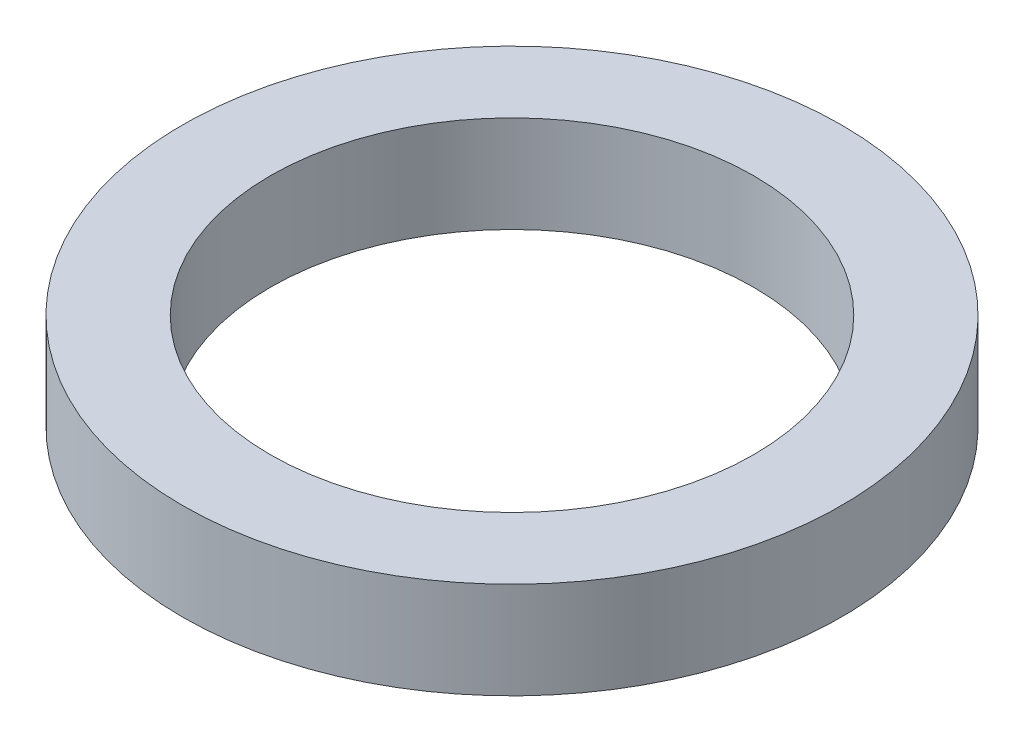
ISO-10303-21;
HEADER;
FILE_DESCRIPTION(('STEP AP214'),'2;1');
FILE_NAME('part.step','',(''),(''),'','','');
FILE_SCHEMA(('AUTOMOTIVE_DESIGN { 1 0 10303 214 1 1 1 1 }'));
ENDSEC;
DATA;
#1=APPLICATION_CONTEXT('core data for automotive mechanical design processes');
#2=APPLICATION_PROTOCOL_DEFINITION('international standard','automotive_design',2000,#1);
#3=PRODUCT_CONTEXT('',#1,'mechanical');
#4=PRODUCT('Part','Part','',(#3));
#5=PRODUCT_RELATED_PRODUCT_CATEGORY('part','',(#4));
#6=PRODUCT_DEFINITION_FORMATION('','',#4);
#7=PRODUCT_DEFINITION_CONTEXT('part definition',#1,'design');
#8=PRODUCT_DEFINITION('design','',#6,#7);
#9=PRODUCT_DEFINITION_SHAPE('','',#8);
#10=(LENGTH_UNIT() NAMED_UNIT(*) SI_UNIT(.MILLI.,.METRE.));
#11=(NAMED_UNIT(*) PLANE_ANGLE_UNIT() SI_UNIT($,.RADIAN.));
#12=(NAMED_UNIT(*) SI_UNIT($,.STERADIAN.) SOLID_ANGLE_UNIT());
#13=UNCERTAINTY_MEASURE_WITH_UNIT(LENGTH_MEASURE(1.E-05),#10,'distance_accuracy_value','');
#14=(GEOMETRIC_REPRESENTATION_CONTEXT(3) GLOBAL_UNCERTAINTY_ASSIGNED_CONTEXT((#13)) GLOBAL_UNIT_ASSIGNED_CONTEXT((#10,
#11,#12)) REPRESENTATION_CONTEXT('',''));
#15=CARTESIAN_POINT('',(0.,0.,0.));
#16=DIRECTION('',(0.,0.,1.));
#17=DIRECTION('',(1.,0.,0.));
#18=AXIS2_PLACEMENT_3D('',#15,#16,#17);
#19=CARTESIAN_POINT('',(0.,11.,0.));
#20=DIRECTION('',(0.,-1.,0.));
#21=DIRECTION('',(0.,0.,-1.));
#22=AXIS2_PLACEMENT_3D('',#19,#20,#21);
#23=CYLINDRICAL_SURFACE('',#22,37.5);
#24=CARTESIAN_POINT('',(0.,11.,0.));
#25=DIRECTION('',(0.,1.,0.));
#26=DIRECTION('',(0.,0.,1.));
#27=AXIS2_PLACEMENT_3D('',#24,#25,#26);
#28=CIRCLE('',#27,37.5);
#29=CARTESIAN_POINT('',(0.,11.,37.5));
#30=VERTEX_POINT('',#29);
#31=EDGE_CURVE('E10',#30,#30,#28,.T.);
#32=ORIENTED_EDGE('',*,*,#31,.F.);
#33=EDGE_LOOP('',(#32));
#34=FACE_BOUND('',#33,.T.);
#35=CARTESIAN_POINT('',(0.,0.,0.));
#36=DIRECTION('',(0.,1.,0.));
#37=DIRECTION('',(0.,0.,1.));
#38=AXIS2_PLACEMENT_3D('',#35,#36,#37);
#39=CIRCLE('',#38,37.5);
#40=CARTESIAN_POINT('',(0.,0.,37.5));
#41=VERTEX_POINT('',#40);
#42=EDGE_CURVE('E37',#41,#41,#39,.T.);
#43=ORIENTED_EDGE('',*,*,#42,.T.);
#44=EDGE_LOOP('',(#43));
#45=FACE_BOUND('',#44,.T.);
#46=ADVANCED_FACE('F40',(#34,#45),#23,.T.);
#47=CARTESIAN_POINT('',(0.,11.,0.));
#48=DIRECTION('',(0.,1.,0.));
#49=DIRECTION('',(0.,0.,1.));
#50=AXIS2_PLACEMENT_3D('',#47,#48,#49);
#51=PLANE('',#50);
#52=CARTESIAN_POINT('',(0.,11.,0.));
#53=DIRECTION('',(0.,1.,0.));
#54=DIRECTION('',(0.,0.,1.));
#55=AXIS2_PLACEMENT_3D('',#52,#53,#54);
#56=CIRCLE('',#55,27.5);
#57=CARTESIAN_POINT('',(0.,11.,27.5));
#58=VERTEX_POINT('',#57);
#59=EDGE_CURVE('E50',#58,#58,#56,.T.);
#60=ORIENTED_EDGE('',*,*,#59,.F.);
#61=EDGE_LOOP('',(#60));
#62=FACE_BOUND('',#61,.T.);
#63=ORIENTED_EDGE('',*,*,#31,.T.);
#64=EDGE_LOOP('',(#63));
#65=FACE_BOUND('',#64,.T.);
#66=ADVANCED_FACE('F59',(#62,#65),#51,.T.);
#67=CARTESIAN_POINT('',(0.,0.,0.));
#68=DIRECTION('',(0.,1.,0.));
#69=DIRECTION('',(0.,0.,1.));
#70=AXIS2_PLACEMENT_3D('',#67,#68,#69);
#71=PLANE('',#70);
#72=CARTESIAN_POINT('',(0.,0.,0.));
#73=DIRECTION('',(0.,1.,0.));
#74=DIRECTION('',(0.,0.,1.));
#75=AXIS2_PLACEMENT_3D('',#72,#73,#74);
#76=CIRCLE('',#75,27.5);
#77=CARTESIAN_POINT('',(0.,0.,27.5));
#78=VERTEX_POINT('',#77);
#79=EDGE_CURVE('E47',#78,#78,#76,.T.);
#80=ORIENTED_EDGE('',*,*,#79,.T.);
#81=EDGE_LOOP('',(#80));
#82=FACE_BOUND('',#81,.T.);
#83=ORIENTED_EDGE('',*,*,#42,.F.);
#84=EDGE_LOOP('',(#83));
#85=FACE_BOUND('',#84,.T.);
#86=ADVANCED_FACE('F58',(#82,#85),#71,.F.);
#87=CARTESIAN_POINT('',(0.,11.,0.));
#88=DIRECTION('',(0.,-1.,0.));
#89=DIRECTION('',(0.,0.,-1.));
#90=AXIS2_PLACEMENT_3D('',#87,#88,#89);
#91=CYLINDRICAL_SURFACE('',#90,27.5);
#92=ORIENTED_EDGE('',*,*,#59,.T.);
#93=EDGE_LOOP('',(#92));
#94=FACE_BOUND('',#93,.T.);
#95=ORIENTED_EDGE('',*,*,#79,.F.);
#96=EDGE_LOOP('',(#95));
#97=FACE_BOUND('',#96,.T.);
#98=ADVANCED_FACE('F54',(#94,#97),#91,.F.);
#99=CLOSED_SHELL('',(#46,#66,#86,#98));
#100=MANIFOLD_SOLID_BREP('B2',#99);
#101=ADVANCED_BREP_SHAPE_REPRESENTATION('',(#18,#100),#14);
#102=SHAPE_DEFINITION_REPRESENTATION(#9,#101);
ENDSEC;
END-ISO-10303-21;
